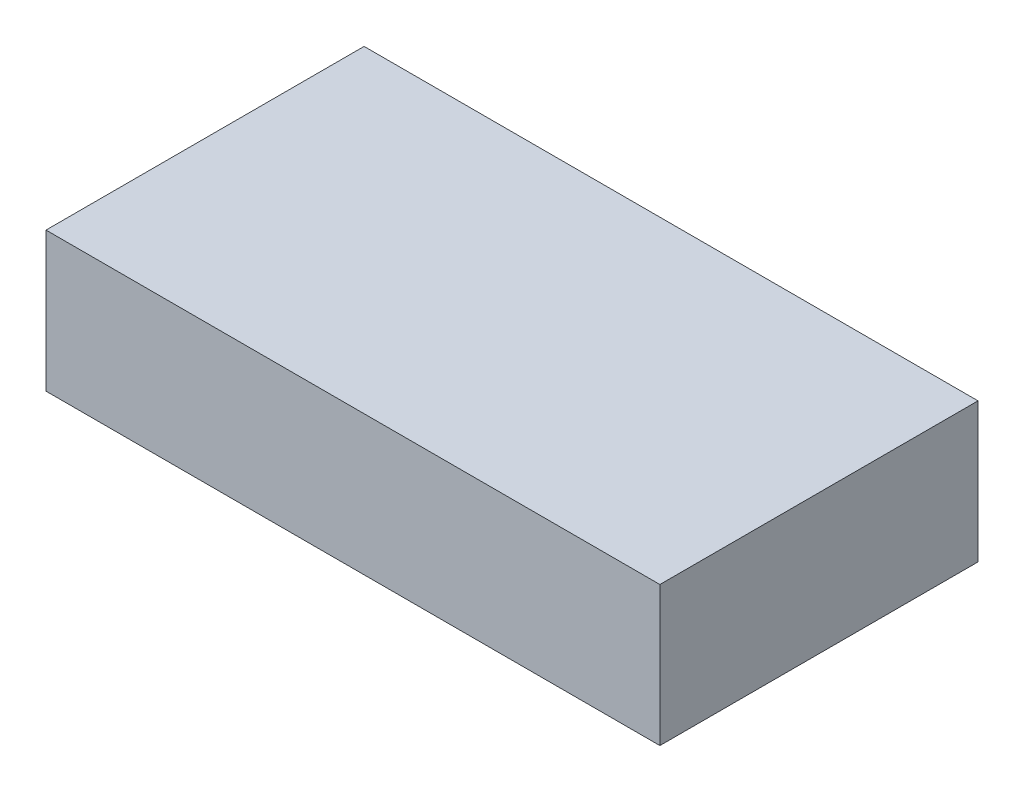
ISO-10303-21;
HEADER;
FILE_DESCRIPTION(('STEP AP214'),'2;1');
FILE_NAME('part.step','',(''),(''),'','','');
FILE_SCHEMA(('AUTOMOTIVE_DESIGN { 1 0 10303 214 1 1 1 1 }'));
ENDSEC;
DATA;
#1=APPLICATION_CONTEXT('core data for automotive mechanical design processes');
#2=APPLICATION_PROTOCOL_DEFINITION('international standard','automotive_design',2000,#1);
#3=PRODUCT_CONTEXT('',#1,'mechanical');
#4=PRODUCT('Part','Part','',(#3));
#5=PRODUCT_RELATED_PRODUCT_CATEGORY('part','',(#4));
#6=PRODUCT_DEFINITION_FORMATION('','',#4);
#7=PRODUCT_DEFINITION_CONTEXT('part definition',#1,'design');
#8=PRODUCT_DEFINITION('design','',#6,#7);
#9=PRODUCT_DEFINITION_SHAPE('','',#8);
#10=(LENGTH_UNIT() NAMED_UNIT(*) SI_UNIT(.MILLI.,.METRE.));
#11=(NAMED_UNIT(*) PLANE_ANGLE_UNIT() SI_UNIT($,.RADIAN.));
#12=(NAMED_UNIT(*) SI_UNIT($,.STERADIAN.) SOLID_ANGLE_UNIT());
#13=UNCERTAINTY_MEASURE_WITH_UNIT(LENGTH_MEASURE(1.E-05),#10,'distance_accuracy_value','');
#14=(GEOMETRIC_REPRESENTATION_CONTEXT(3) GLOBAL_UNCERTAINTY_ASSIGNED_CONTEXT((#13)) GLOBAL_UNIT_ASSIGNED_CONTEXT((#10,
#11,#12)) REPRESENTATION_CONTEXT('',''));
#15=CARTESIAN_POINT('',(0.,0.,0.));
#16=DIRECTION('',(0.,0.,1.));
#17=DIRECTION('',(1.,0.,0.));
#18=AXIS2_PLACEMENT_3D('',#15,#16,#17);
#19=CARTESIAN_POINT('',(110.,50.,-57.));
#20=DIRECTION('',(-1.,0.,0.));
#21=DIRECTION('',(0.,0.,1.));
#22=AXIS2_PLACEMENT_3D('',#19,#20,#21);
#23=PLANE('',#22);
#24=DIRECTION('',(0.,0.,-1.));
#25=VECTOR('',#24,1.);
#26=CARTESIAN_POINT('',(110.,0.,-57.));
#27=LINE('',#26,#25);
#28=CARTESIAN_POINT('',(110.,0.,57.));
#29=VERTEX_POINT('',#28);
#30=CARTESIAN_POINT('',(110.,0.,-57.));
#31=VERTEX_POINT('',#30);
#32=EDGE_CURVE('E97',#29,#31,#27,.T.);
#33=ORIENTED_EDGE('',*,*,#32,.T.);
#34=DIRECTION('',(0.,-1.,0.));
#35=VECTOR('',#34,1.);
#36=CARTESIAN_POINT('',(110.,50.,-57.));
#37=LINE('',#36,#35);
#38=CARTESIAN_POINT('',(110.,50.,-57.));
#39=VERTEX_POINT('',#38);
#40=EDGE_CURVE('E11',#39,#31,#37,.T.);
#41=ORIENTED_EDGE('',*,*,#40,.F.);
#42=DIRECTION('',(0.,0.,-1.));
#43=VECTOR('',#42,1.);
#44=CARTESIAN_POINT('',(110.,50.,-57.));
#45=LINE('',#44,#43);
#46=CARTESIAN_POINT('',(110.,50.,57.));
#47=VERTEX_POINT('',#46);
#48=EDGE_CURVE('E85',#47,#39,#45,.T.);
#49=ORIENTED_EDGE('',*,*,#48,.F.);
#50=DIRECTION('',(0.,-1.,0.));
#51=VECTOR('',#50,1.);
#52=CARTESIAN_POINT('',(110.,50.,57.));
#53=LINE('',#52,#51);
#54=EDGE_CURVE('E93',#47,#29,#53,.T.);
#55=ORIENTED_EDGE('',*,*,#54,.T.);
#56=EDGE_LOOP('',(#33,#41,#49,#55));
#57=FACE_BOUND('',#56,.T.);
#58=ADVANCED_FACE('F34',(#57),#23,.F.);
#59=CARTESIAN_POINT('',(-110.,50.,-57.));
#60=DIRECTION('',(0.,0.,1.));
#61=DIRECTION('',(1.,0.,0.));
#62=AXIS2_PLACEMENT_3D('',#59,#60,#61);
#63=PLANE('',#62);
#64=DIRECTION('',(-1.,0.,0.));
#65=VECTOR('',#64,1.);
#66=CARTESIAN_POINT('',(-110.,0.,-57.));
#67=LINE('',#66,#65);
#68=CARTESIAN_POINT('',(-110.,0.,-57.));
#69=VERTEX_POINT('',#68);
#70=EDGE_CURVE('E89',#31,#69,#67,.T.);
#71=ORIENTED_EDGE('',*,*,#70,.T.);
#72=DIRECTION('',(0.,-1.,0.));
#73=VECTOR('',#72,1.);
#74=CARTESIAN_POINT('',(-110.,50.,-57.));
#75=LINE('',#74,#73);
#76=CARTESIAN_POINT('',(-110.,50.,-57.));
#77=VERTEX_POINT('',#76);
#78=EDGE_CURVE('E42',#77,#69,#75,.T.);
#79=ORIENTED_EDGE('',*,*,#78,.F.);
#80=DIRECTION('',(-1.,0.,0.));
#81=VECTOR('',#80,1.);
#82=CARTESIAN_POINT('',(-110.,50.,-57.));
#83=LINE('',#82,#81);
#84=EDGE_CURVE('E80',#39,#77,#83,.T.);
#85=ORIENTED_EDGE('',*,*,#84,.F.);
#86=ORIENTED_EDGE('',*,*,#40,.T.);
#87=EDGE_LOOP('',(#71,#79,#85,#86));
#88=FACE_BOUND('',#87,.T.);
#89=ADVANCED_FACE('F88',(#88),#63,.F.);
#90=CARTESIAN_POINT('',(-110.,50.,-57.));
#91=DIRECTION('',(1.,0.,0.));
#92=DIRECTION('',(0.,0.,-1.));
#93=AXIS2_PLACEMENT_3D('',#90,#91,#92);
#94=PLANE('',#93);
#95=DIRECTION('',(0.,0.,1.));
#96=VECTOR('',#95,1.);
#97=CARTESIAN_POINT('',(-110.,0.,-57.));
#98=LINE('',#97,#96);
#99=CARTESIAN_POINT('',(-110.,0.,57.));
#100=VERTEX_POINT('',#99);
#101=EDGE_CURVE('E67',#69,#100,#98,.T.);
#102=ORIENTED_EDGE('',*,*,#101,.T.);
#103=DIRECTION('',(0.,-1.,0.));
#104=VECTOR('',#103,1.);
#105=CARTESIAN_POINT('',(-110.,50.,57.));
#106=LINE('',#105,#104);
#107=CARTESIAN_POINT('',(-110.,50.,57.));
#108=VERTEX_POINT('',#107);
#109=EDGE_CURVE('E90',#108,#100,#106,.T.);
#110=ORIENTED_EDGE('',*,*,#109,.F.);
#111=DIRECTION('',(0.,0.,1.));
#112=VECTOR('',#111,1.);
#113=CARTESIAN_POINT('',(-110.,50.,-57.));
#114=LINE('',#113,#112);
#115=EDGE_CURVE('E83',#77,#108,#114,.T.);
#116=ORIENTED_EDGE('',*,*,#115,.F.);
#117=ORIENTED_EDGE('',*,*,#78,.T.);
#118=EDGE_LOOP('',(#102,#110,#116,#117));
#119=FACE_BOUND('',#118,.T.);
#120=ADVANCED_FACE('F91',(#119),#94,.F.);
#121=CARTESIAN_POINT('',(-110.,50.,57.));
#122=DIRECTION('',(0.,0.,-1.));
#123=DIRECTION('',(-1.,0.,0.));
#124=AXIS2_PLACEMENT_3D('',#121,#122,#123);
#125=PLANE('',#124);
#126=DIRECTION('',(1.,0.,0.));
#127=VECTOR('',#126,1.);
#128=CARTESIAN_POINT('',(-110.,0.,57.));
#129=LINE('',#128,#127);
#130=EDGE_CURVE('E73',#100,#29,#129,.T.);
#131=ORIENTED_EDGE('',*,*,#130,.T.);
#132=ORIENTED_EDGE('',*,*,#54,.F.);
#133=DIRECTION('',(1.,0.,0.));
#134=VECTOR('',#133,1.);
#135=CARTESIAN_POINT('',(-110.,50.,57.));
#136=LINE('',#135,#134);
#137=EDGE_CURVE('E50',#108,#47,#136,.T.);
#138=ORIENTED_EDGE('',*,*,#137,.F.);
#139=ORIENTED_EDGE('',*,*,#109,.T.);
#140=EDGE_LOOP('',(#131,#132,#138,#139));
#141=FACE_BOUND('',#140,.T.);
#142=ADVANCED_FACE('F104',(#141),#125,.F.);
#143=CARTESIAN_POINT('',(0.,50.,0.));
#144=DIRECTION('',(0.,1.,0.));
#145=DIRECTION('',(0.,0.,1.));
#146=AXIS2_PLACEMENT_3D('',#143,#144,#145);
#147=PLANE('',#146);
#148=ORIENTED_EDGE('',*,*,#48,.T.);
#149=ORIENTED_EDGE('',*,*,#84,.T.);
#150=ORIENTED_EDGE('',*,*,#115,.T.);
#151=ORIENTED_EDGE('',*,*,#137,.T.);
#152=EDGE_LOOP('',(#148,#149,#150,#151));
#153=FACE_BOUND('',#152,.T.);
#154=ADVANCED_FACE('F81',(#153),#147,.T.);
#155=CARTESIAN_POINT('',(0.,0.,0.));
#156=DIRECTION('',(0.,1.,0.));
#157=DIRECTION('',(0.,0.,1.));
#158=AXIS2_PLACEMENT_3D('',#155,#156,#157);
#159=PLANE('',#158);
#160=ORIENTED_EDGE('',*,*,#32,.F.);
#161=ORIENTED_EDGE('',*,*,#130,.F.);
#162=ORIENTED_EDGE('',*,*,#101,.F.);
#163=ORIENTED_EDGE('',*,*,#70,.F.);
#164=EDGE_LOOP('',(#160,#161,#162,#163));
#165=FACE_BOUND('',#164,.T.);
#166=ADVANCED_FACE('F107',(#165),#159,.F.);
#167=CLOSED_SHELL('',(#58,#89,#120,#142,#154,#166));
#168=MANIFOLD_SOLID_BREP('B2',#167);
#169=ADVANCED_BREP_SHAPE_REPRESENTATION('',(#18,#168),#14);
#170=SHAPE_DEFINITION_REPRESENTATION(#9,#169);
ENDSEC;
END-ISO-10303-21;
